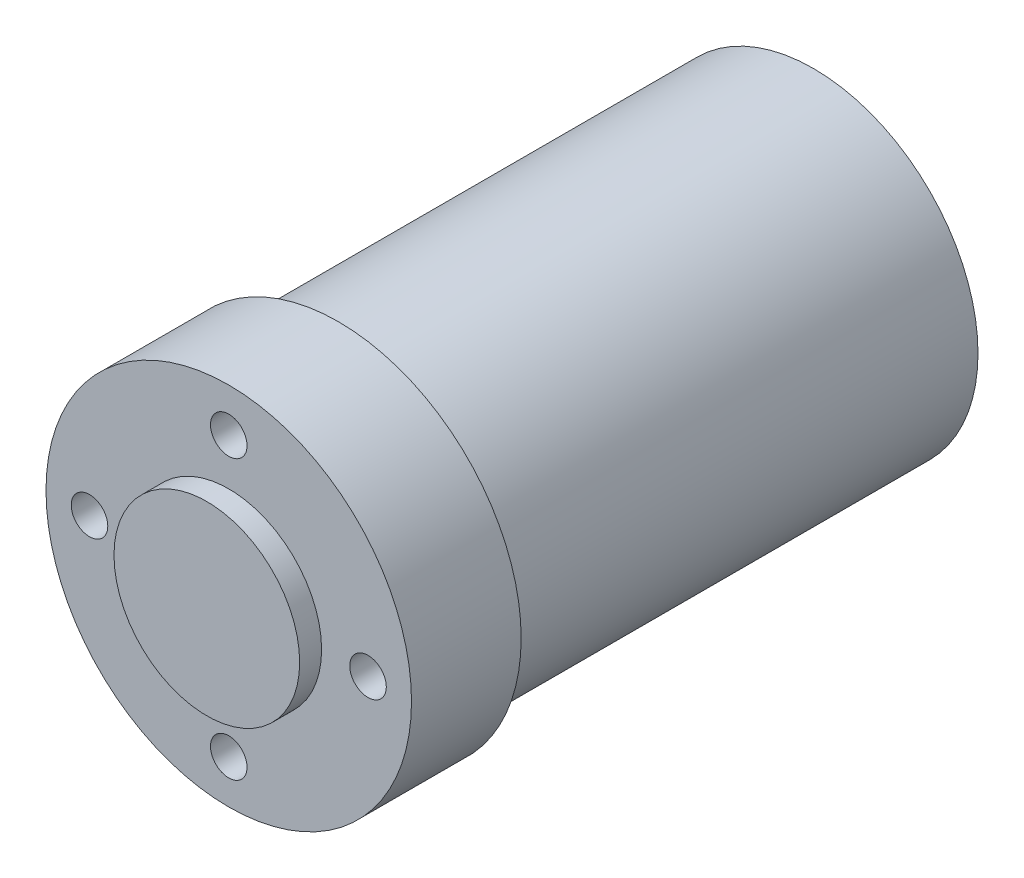
ISO-10303-21;
HEADER;
FILE_DESCRIPTION(('STEP AP214'),'2;1');
FILE_NAME('part.step','',(''),(''),'','','');
FILE_SCHEMA(('AUTOMOTIVE_DESIGN { 1 0 10303 214 1 1 1 1 }'));
ENDSEC;
DATA;
#1=APPLICATION_CONTEXT('core data for automotive mechanical design processes');
#2=APPLICATION_PROTOCOL_DEFINITION('international standard','automotive_design',2000,#1);
#3=PRODUCT_CONTEXT('',#1,'mechanical');
#4=PRODUCT('Part','Part','',(#3));
#5=PRODUCT_RELATED_PRODUCT_CATEGORY('part','',(#4));
#6=PRODUCT_DEFINITION_FORMATION('','',#4);
#7=PRODUCT_DEFINITION_CONTEXT('part definition',#1,'design');
#8=PRODUCT_DEFINITION('design','',#6,#7);
#9=PRODUCT_DEFINITION_SHAPE('','',#8);
#10=(LENGTH_UNIT() NAMED_UNIT(*) SI_UNIT(.MILLI.,.METRE.));
#11=(NAMED_UNIT(*) PLANE_ANGLE_UNIT() SI_UNIT($,.RADIAN.));
#12=(NAMED_UNIT(*) SI_UNIT($,.STERADIAN.) SOLID_ANGLE_UNIT());
#13=UNCERTAINTY_MEASURE_WITH_UNIT(LENGTH_MEASURE(1.E-05),#10,'distance_accuracy_value','');
#14=(GEOMETRIC_REPRESENTATION_CONTEXT(3) GLOBAL_UNCERTAINTY_ASSIGNED_CONTEXT((#13)) GLOBAL_UNIT_ASSIGNED_CONTEXT((#10,
#11,#12)) REPRESENTATION_CONTEXT('',''));
#15=CARTESIAN_POINT('',(0.,0.,0.));
#16=DIRECTION('',(0.,0.,1.));
#17=DIRECTION('',(1.,0.,0.));
#18=AXIS2_PLACEMENT_3D('',#15,#16,#17);
#19=CARTESIAN_POINT('',(0.,0.,80.));
#20=DIRECTION('',(0.,0.,-1.));
#21=DIRECTION('',(-1.,0.,0.));
#22=AXIS2_PLACEMENT_3D('',#19,#20,#21);
#23=CYLINDRICAL_SURFACE('',#22,25.);
#24=CARTESIAN_POINT('',(0.,0.,80.));
#25=DIRECTION('',(0.,0.,-1.));
#26=DIRECTION('',(-1.,0.,0.));
#27=AXIS2_PLACEMENT_3D('',#24,#25,#26);
#28=CIRCLE('',#27,25.);
#29=CARTESIAN_POINT('',(-25.,0.,80.));
#30=VERTEX_POINT('',#29);
#31=EDGE_CURVE('E10',#30,#30,#28,.T.);
#32=ORIENTED_EDGE('',*,*,#31,.T.);
#33=EDGE_LOOP('',(#32));
#34=FACE_BOUND('',#33,.T.);
#35=CARTESIAN_POINT('',(0.,0.,65.));
#36=DIRECTION('',(0.,0.,-1.));
#37=DIRECTION('',(-1.,0.,0.));
#38=AXIS2_PLACEMENT_3D('',#35,#36,#37);
#39=CIRCLE('',#38,25.);
#40=CARTESIAN_POINT('',(-25.,0.,65.));
#41=VERTEX_POINT('',#40);
#42=EDGE_CURVE('E39',#41,#41,#39,.T.);
#43=ORIENTED_EDGE('',*,*,#42,.F.);
#44=EDGE_LOOP('',(#43));
#45=FACE_BOUND('',#44,.T.);
#46=ADVANCED_FACE('F33',(#34,#45),#23,.T.);
#47=CARTESIAN_POINT('',(25.,0.,80.));
#48=DIRECTION('',(0.,0.,1.));
#49=DIRECTION('',(1.,0.,0.));
#50=AXIS2_PLACEMENT_3D('',#47,#48,#49);
#51=PLANE('',#50);
#52=CARTESIAN_POINT('',(-19.0499999999995,-5.41433564649196E-13,80.));
#53=DIRECTION('',(0.,0.,1.));
#54=DIRECTION('',(1.,0.,0.));
#55=AXIS2_PLACEMENT_3D('',#52,#53,#54);
#56=CIRCLE('',#55,2.50000000000086);
#57=CARTESIAN_POINT('',(-16.5499999999986,-5.41433564649196E-13,80.));
#58=VERTEX_POINT('',#57);
#59=EDGE_CURVE('E127',#58,#58,#56,.T.);
#60=ORIENTED_EDGE('',*,*,#59,.F.);
#61=EDGE_LOOP('',(#60));
#62=FACE_BOUND('',#61,.T.);
#63=CARTESIAN_POINT('',(1.07820122499364E-12,-19.05,80.));
#64=DIRECTION('',(0.,0.,1.));
#65=DIRECTION('',(1.,0.,0.));
#66=AXIS2_PLACEMENT_3D('',#63,#64,#65);
#67=CIRCLE('',#66,2.50000000000086);
#68=CARTESIAN_POINT('',(2.50000000000193,-19.05,80.));
#69=VERTEX_POINT('',#68);
#70=EDGE_CURVE('E121',#69,#69,#67,.T.);
#71=ORIENTED_EDGE('',*,*,#70,.F.);
#72=EDGE_LOOP('',(#71));
#73=FACE_BOUND('',#72,.T.);
#74=CARTESIAN_POINT('',(19.0500000000005,5.39100612496821E-13,80.));
#75=DIRECTION('',(0.,0.,1.));
#76=DIRECTION('',(1.,0.,0.));
#77=AXIS2_PLACEMENT_3D('',#74,#75,#76);
#78=CIRCLE('',#77,2.50000000000086);
#79=CARTESIAN_POINT('',(21.5500000000014,5.39100612496821E-13,80.));
#80=VERTEX_POINT('',#79);
#81=EDGE_CURVE('E115',#80,#80,#78,.T.);
#82=ORIENTED_EDGE('',*,*,#81,.F.);
#83=EDGE_LOOP('',(#82));
#84=FACE_BOUND('',#83,.T.);
#85=CARTESIAN_POINT('',(0.,19.05,80.));
#86=DIRECTION('',(0.,0.,1.));
#87=DIRECTION('',(1.,0.,0.));
#88=AXIS2_PLACEMENT_3D('',#85,#86,#87);
#89=CIRCLE('',#88,2.50000000000086);
#90=CARTESIAN_POINT('',(2.50000000000086,19.05,80.));
#91=VERTEX_POINT('',#90);
#92=EDGE_CURVE('E109',#91,#91,#89,.T.);
#93=ORIENTED_EDGE('',*,*,#92,.F.);
#94=EDGE_LOOP('',(#93));
#95=FACE_BOUND('',#94,.T.);
#96=CARTESIAN_POINT('',(0.,0.,80.));
#97=DIRECTION('',(0.,0.,1.));
#98=DIRECTION('',(1.,0.,0.));
#99=AXIS2_PLACEMENT_3D('',#96,#97,#98);
#100=CIRCLE('',#99,12.7);
#101=CARTESIAN_POINT('',(12.7,0.,80.));
#102=VERTEX_POINT('',#101);
#103=EDGE_CURVE('E47',#102,#102,#100,.T.);
#104=ORIENTED_EDGE('',*,*,#103,.F.);
#105=EDGE_LOOP('',(#104));
#106=FACE_BOUND('',#105,.T.);
#107=ORIENTED_EDGE('',*,*,#31,.F.);
#108=EDGE_LOOP('',(#107));
#109=FACE_BOUND('',#108,.T.);
#110=ADVANCED_FACE('F133',(#62,#73,#84,#95,#106,#109),#51,.T.);
#111=CARTESIAN_POINT('',(0.,0.,65.));
#112=DIRECTION('',(0.,0.,-1.));
#113=DIRECTION('',(-1.,0.,0.));
#114=AXIS2_PLACEMENT_3D('',#111,#112,#113);
#115=PLANE('',#114);
#116=CARTESIAN_POINT('',(0.,0.,65.));
#117=DIRECTION('',(0.,0.,-1.));
#118=DIRECTION('',(-1.,0.,0.));
#119=AXIS2_PLACEMENT_3D('',#116,#117,#118);
#120=CIRCLE('',#119,22.4917);
#121=CARTESIAN_POINT('',(-22.4917,0.,65.));
#122=VERTEX_POINT('',#121);
#123=EDGE_CURVE('E53',#122,#122,#120,.T.);
#124=ORIENTED_EDGE('',*,*,#123,.F.);
#125=EDGE_LOOP('',(#124));
#126=FACE_BOUND('',#125,.T.);
#127=ORIENTED_EDGE('',*,*,#42,.T.);
#128=EDGE_LOOP('',(#127));
#129=FACE_BOUND('',#128,.T.);
#130=ADVANCED_FACE('F136',(#126,#129),#115,.T.);
#131=CARTESIAN_POINT('',(0.,0.,83.));
#132=DIRECTION('',(0.,0.,-1.));
#133=DIRECTION('',(-1.,0.,0.));
#134=AXIS2_PLACEMENT_3D('',#131,#132,#133);
#135=CYLINDRICAL_SURFACE('',#134,12.7);
#136=CARTESIAN_POINT('',(0.,0.,83.));
#137=DIRECTION('',(0.,0.,1.));
#138=DIRECTION('',(1.,0.,0.));
#139=AXIS2_PLACEMENT_3D('',#136,#137,#138);
#140=CIRCLE('',#139,12.7);
#141=CARTESIAN_POINT('',(12.7,0.,83.));
#142=VERTEX_POINT('',#141);
#143=EDGE_CURVE('E43',#142,#142,#140,.T.);
#144=ORIENTED_EDGE('',*,*,#143,.F.);
#145=EDGE_LOOP('',(#144));
#146=FACE_BOUND('',#145,.T.);
#147=ORIENTED_EDGE('',*,*,#103,.T.);
#148=EDGE_LOOP('',(#147));
#149=FACE_BOUND('',#148,.T.);
#150=ADVANCED_FACE('F146',(#146,#149),#135,.T.);
#151=CARTESIAN_POINT('',(0.,0.,83.));
#152=DIRECTION('',(0.,0.,1.));
#153=DIRECTION('',(1.,0.,0.));
#154=AXIS2_PLACEMENT_3D('',#151,#152,#153);
#155=PLANE('',#154);
#156=ORIENTED_EDGE('',*,*,#143,.T.);
#157=EDGE_LOOP('',(#156));
#158=FACE_BOUND('',#157,.T.);
#159=ADVANCED_FACE('F148',(#158),#155,.T.);
#160=CARTESIAN_POINT('',(0.,0.,0.));
#161=DIRECTION('',(0.,0.,1.));
#162=DIRECTION('',(1.,0.,0.));
#163=AXIS2_PLACEMENT_3D('',#160,#161,#162);
#164=CYLINDRICAL_SURFACE('',#163,22.4917);
#165=CARTESIAN_POINT('',(0.,0.,0.));
#166=DIRECTION('',(0.,0.,-1.));
#167=DIRECTION('',(-1.,0.,0.));
#168=AXIS2_PLACEMENT_3D('',#165,#166,#167);
#169=CIRCLE('',#168,22.4917);
#170=CARTESIAN_POINT('',(-22.4917,0.,0.));
#171=VERTEX_POINT('',#170);
#172=EDGE_CURVE('E51',#171,#171,#169,.T.);
#173=ORIENTED_EDGE('',*,*,#172,.F.);
#174=EDGE_LOOP('',(#173));
#175=FACE_BOUND('',#174,.T.);
#176=ORIENTED_EDGE('',*,*,#123,.T.);
#177=EDGE_LOOP('',(#176));
#178=FACE_BOUND('',#177,.T.);
#179=ADVANCED_FACE('F155',(#175,#178),#164,.T.);
#180=CARTESIAN_POINT('',(0.,0.,0.));
#181=DIRECTION('',(0.,0.,-1.));
#182=DIRECTION('',(-1.,0.,0.));
#183=AXIS2_PLACEMENT_3D('',#180,#181,#182);
#184=PLANE('',#183);
#185=CARTESIAN_POINT('',(12.3743686707641,12.3743686707635,0.));
#186=DIRECTION('',(0.,0.,-1.));
#187=DIRECTION('',(-1.,0.,0.));
#188=AXIS2_PLACEMENT_3D('',#185,#186,#187);
#189=CIRCLE('',#188,2.49999999999999);
#190=CARTESIAN_POINT('',(9.87436867076416,12.3743686707635,0.));
#191=VERTEX_POINT('',#190);
#192=EDGE_CURVE('E103',#191,#191,#189,.T.);
#193=ORIENTED_EDGE('',*,*,#192,.F.);
#194=EDGE_LOOP('',(#193));
#195=FACE_BOUND('',#194,.T.);
#196=CARTESIAN_POINT('',(17.4999999999985,-1.49213974509621E-12,0.));
#197=DIRECTION('',(0.,0.,-1.));
#198=DIRECTION('',(-1.,0.,0.));
#199=AXIS2_PLACEMENT_3D('',#196,#197,#198);
#200=CIRCLE('',#199,2.49999999999999);
#201=CARTESIAN_POINT('',(14.9999999999985,-1.49213974509621E-12,0.));
#202=VERTEX_POINT('',#201);
#203=EDGE_CURVE('E97',#202,#202,#200,.T.);
#204=ORIENTED_EDGE('',*,*,#203,.F.);
#205=EDGE_LOOP('',(#204));
#206=FACE_BOUND('',#205,.T.);
#207=CARTESIAN_POINT('',(12.374368670762,-12.3743686707656,0.));
#208=DIRECTION('',(0.,0.,-1.));
#209=DIRECTION('',(-1.,0.,0.));
#210=AXIS2_PLACEMENT_3D('',#207,#208,#209);
#211=CIRCLE('',#210,2.49999999999999);
#212=CARTESIAN_POINT('',(9.87436867076205,-12.3743686707656,0.));
#213=VERTEX_POINT('',#212);
#214=EDGE_CURVE('E91',#213,#213,#211,.T.);
#215=ORIENTED_EDGE('',*,*,#214,.F.);
#216=EDGE_LOOP('',(#215));
#217=FACE_BOUND('',#216,.T.);
#218=CARTESIAN_POINT('',(-2.97999322639541E-12,-17.5,0.));
#219=DIRECTION('',(0.,0.,-1.));
#220=DIRECTION('',(-1.,0.,0.));
#221=AXIS2_PLACEMENT_3D('',#218,#219,#220);
#222=CIRCLE('',#221,2.49999999999999);
#223=CARTESIAN_POINT('',(-2.50000000000297,-17.5,0.));
#224=VERTEX_POINT('',#223);
#225=EDGE_CURVE('E85',#224,#224,#222,.T.);
#226=ORIENTED_EDGE('',*,*,#225,.F.);
#227=EDGE_LOOP('',(#226));
#228=FACE_BOUND('',#227,.T.);
#229=CARTESIAN_POINT('',(-12.3743686707671,-12.3743686707635,0.));
#230=DIRECTION('',(0.,0.,-1.));
#231=DIRECTION('',(-1.,0.,0.));
#232=AXIS2_PLACEMENT_3D('',#229,#230,#231);
#233=CIRCLE('',#232,2.49999999999999);
#234=CARTESIAN_POINT('',(-14.8743686707671,-12.3743686707635,0.));
#235=VERTEX_POINT('',#234);
#236=EDGE_CURVE('E79',#235,#235,#233,.T.);
#237=ORIENTED_EDGE('',*,*,#236,.F.);
#238=EDGE_LOOP('',(#237));
#239=FACE_BOUND('',#238,.T.);
#240=CARTESIAN_POINT('',(-17.5000000000015,1.4899966131977E-12,0.));
#241=DIRECTION('',(0.,0.,-1.));
#242=DIRECTION('',(-1.,0.,0.));
#243=AXIS2_PLACEMENT_3D('',#240,#241,#242);
#244=CIRCLE('',#243,2.49999999999999);
#245=CARTESIAN_POINT('',(-20.0000000000015,1.4899966131977E-12,0.));
#246=VERTEX_POINT('',#245);
#247=EDGE_CURVE('E73',#246,#246,#244,.T.);
#248=ORIENTED_EDGE('',*,*,#247,.F.);
#249=EDGE_LOOP('',(#248));
#250=FACE_BOUND('',#249,.T.);
#251=CARTESIAN_POINT('',(-12.374368670765,12.3743686707656,0.));
#252=DIRECTION('',(0.,0.,-1.));
#253=DIRECTION('',(-1.,0.,0.));
#254=AXIS2_PLACEMENT_3D('',#251,#252,#253);
#255=CIRCLE('',#254,2.49999999999999);
#256=CARTESIAN_POINT('',(-14.874368670765,12.3743686707656,0.));
#257=VERTEX_POINT('',#256);
#258=EDGE_CURVE('E67',#257,#257,#255,.T.);
#259=ORIENTED_EDGE('',*,*,#258,.F.);
#260=EDGE_LOOP('',(#259));
#261=FACE_BOUND('',#260,.T.);
#262=CARTESIAN_POINT('',(0.,17.5,0.));
#263=DIRECTION('',(0.,0.,-1.));
#264=DIRECTION('',(-1.,0.,0.));
#265=AXIS2_PLACEMENT_3D('',#262,#263,#264);
#266=CIRCLE('',#265,2.49999999999999);
#267=CARTESIAN_POINT('',(-2.49999999999999,17.5,0.));
#268=VERTEX_POINT('',#267);
#269=EDGE_CURVE('E61',#268,#268,#266,.T.);
#270=ORIENTED_EDGE('',*,*,#269,.F.);
#271=EDGE_LOOP('',(#270));
#272=FACE_BOUND('',#271,.T.);
#273=ORIENTED_EDGE('',*,*,#172,.T.);
#274=EDGE_LOOP('',(#273));
#275=FACE_BOUND('',#274,.T.);
#276=ADVANCED_FACE('F188',(#195,#206,#217,#228,#239,#250,#261,#272,#275),#184,.T.);
#277=CARTESIAN_POINT('',(0.,17.5,7.99999999999999));
#278=DIRECTION('',(0.,0.,1.));
#279=DIRECTION('',(1.,0.,0.));
#280=AXIS2_PLACEMENT_3D('',#277,#278,#279);
#281=PLANE('',#280);
#282=CARTESIAN_POINT('',(0.,17.5,7.99999999999999));
#283=DIRECTION('',(0.,0.,-1.));
#284=DIRECTION('',(-1.,0.,0.));
#285=AXIS2_PLACEMENT_3D('',#282,#283,#284);
#286=CIRCLE('',#285,2.49999999999999);
#287=CARTESIAN_POINT('',(-2.49999999999999,17.5,7.99999999999999));
#288=VERTEX_POINT('',#287);
#289=EDGE_CURVE('E56',#288,#288,#286,.T.);
#290=ORIENTED_EDGE('',*,*,#289,.T.);
#291=EDGE_LOOP('',(#290));
#292=FACE_BOUND('',#291,.T.);
#293=ADVANCED_FACE('F198',(#292),#281,.F.);
#294=CARTESIAN_POINT('',(0.,17.5,0.));
#295=DIRECTION('',(0.,0.,-1.));
#296=DIRECTION('',(-1.,0.,0.));
#297=AXIS2_PLACEMENT_3D('',#294,#295,#296);
#298=CYLINDRICAL_SURFACE('',#297,2.49999999999999);
#299=ORIENTED_EDGE('',*,*,#289,.F.);
#300=EDGE_LOOP('',(#299));
#301=FACE_BOUND('',#300,.T.);
#302=ORIENTED_EDGE('',*,*,#269,.T.);
#303=EDGE_LOOP('',(#302));
#304=FACE_BOUND('',#303,.T.);
#305=ADVANCED_FACE('F208',(#301,#304),#298,.F.);
#306=CARTESIAN_POINT('',(-12.374368670765,12.3743686707656,7.99999999999999));
#307=DIRECTION('',(0.,0.,1.));
#308=DIRECTION('',(1.,0.,0.));
#309=AXIS2_PLACEMENT_3D('',#306,#307,#308);
#310=PLANE('',#309);
#311=CARTESIAN_POINT('',(-12.374368670765,12.3743686707656,7.99999999999999));
#312=DIRECTION('',(0.,0.,-1.));
#313=DIRECTION('',(-1.,0.,0.));
#314=AXIS2_PLACEMENT_3D('',#311,#312,#313);
#315=CIRCLE('',#314,2.49999999999999);
#316=CARTESIAN_POINT('',(-14.874368670765,12.3743686707656,7.99999999999999));
#317=VERTEX_POINT('',#316);
#318=EDGE_CURVE('E64',#317,#317,#315,.T.);
#319=ORIENTED_EDGE('',*,*,#318,.T.);
#320=EDGE_LOOP('',(#319));
#321=FACE_BOUND('',#320,.T.);
#322=ADVANCED_FACE('F218',(#321),#310,.F.);
#323=CARTESIAN_POINT('',(-12.374368670765,12.3743686707656,0.));
#324=DIRECTION('',(0.,0.,-1.));
#325=DIRECTION('',(-1.,0.,0.));
#326=AXIS2_PLACEMENT_3D('',#323,#324,#325);
#327=CYLINDRICAL_SURFACE('',#326,2.49999999999999);
#328=ORIENTED_EDGE('',*,*,#318,.F.);
#329=EDGE_LOOP('',(#328));
#330=FACE_BOUND('',#329,.T.);
#331=ORIENTED_EDGE('',*,*,#258,.T.);
#332=EDGE_LOOP('',(#331));
#333=FACE_BOUND('',#332,.T.);
#334=ADVANCED_FACE('F228',(#330,#333),#327,.F.);
#335=CARTESIAN_POINT('',(-17.5000000000015,1.4899966131977E-12,7.99999999999999));
#336=DIRECTION('',(0.,0.,1.));
#337=DIRECTION('',(1.,0.,0.));
#338=AXIS2_PLACEMENT_3D('',#335,#336,#337);
#339=PLANE('',#338);
#340=CARTESIAN_POINT('',(-17.5000000000015,1.4899966131977E-12,7.99999999999999));
#341=DIRECTION('',(0.,0.,-1.));
#342=DIRECTION('',(-1.,0.,0.));
#343=AXIS2_PLACEMENT_3D('',#340,#341,#342);
#344=CIRCLE('',#343,2.49999999999999);
#345=CARTESIAN_POINT('',(-20.0000000000015,1.4899966131977E-12,7.99999999999999));
#346=VERTEX_POINT('',#345);
#347=EDGE_CURVE('E70',#346,#346,#344,.T.);
#348=ORIENTED_EDGE('',*,*,#347,.T.);
#349=EDGE_LOOP('',(#348));
#350=FACE_BOUND('',#349,.T.);
#351=ADVANCED_FACE('F238',(#350),#339,.F.);
#352=CARTESIAN_POINT('',(-17.5000000000015,1.4899966131977E-12,0.));
#353=DIRECTION('',(0.,0.,-1.));
#354=DIRECTION('',(-1.,0.,0.));
#355=AXIS2_PLACEMENT_3D('',#352,#353,#354);
#356=CYLINDRICAL_SURFACE('',#355,2.49999999999999);
#357=ORIENTED_EDGE('',*,*,#347,.F.);
#358=EDGE_LOOP('',(#357));
#359=FACE_BOUND('',#358,.T.);
#360=ORIENTED_EDGE('',*,*,#247,.T.);
#361=EDGE_LOOP('',(#360));
#362=FACE_BOUND('',#361,.T.);
#363=ADVANCED_FACE('F248',(#359,#362),#356,.F.);
#364=CARTESIAN_POINT('',(-12.3743686707671,-12.3743686707635,7.99999999999999));
#365=DIRECTION('',(0.,0.,1.));
#366=DIRECTION('',(1.,0.,0.));
#367=AXIS2_PLACEMENT_3D('',#364,#365,#366);
#368=PLANE('',#367);
#369=CARTESIAN_POINT('',(-12.3743686707671,-12.3743686707635,7.99999999999999));
#370=DIRECTION('',(0.,0.,-1.));
#371=DIRECTION('',(-1.,0.,0.));
#372=AXIS2_PLACEMENT_3D('',#369,#370,#371);
#373=CIRCLE('',#372,2.49999999999999);
#374=CARTESIAN_POINT('',(-14.8743686707671,-12.3743686707635,7.99999999999999));
#375=VERTEX_POINT('',#374);
#376=EDGE_CURVE('E76',#375,#375,#373,.T.);
#377=ORIENTED_EDGE('',*,*,#376,.T.);
#378=EDGE_LOOP('',(#377));
#379=FACE_BOUND('',#378,.T.);
#380=ADVANCED_FACE('F258',(#379),#368,.F.);
#381=CARTESIAN_POINT('',(-12.3743686707671,-12.3743686707635,0.));
#382=DIRECTION('',(0.,0.,-1.));
#383=DIRECTION('',(-1.,0.,0.));
#384=AXIS2_PLACEMENT_3D('',#381,#382,#383);
#385=CYLINDRICAL_SURFACE('',#384,2.49999999999999);
#386=ORIENTED_EDGE('',*,*,#376,.F.);
#387=EDGE_LOOP('',(#386));
#388=FACE_BOUND('',#387,.T.);
#389=ORIENTED_EDGE('',*,*,#236,.T.);
#390=EDGE_LOOP('',(#389));
#391=FACE_BOUND('',#390,.T.);
#392=ADVANCED_FACE('F268',(#388,#391),#385,.F.);
#393=CARTESIAN_POINT('',(-2.98195266127404E-12,-17.5,7.99999999999999));
#394=DIRECTION('',(0.,0.,1.));
#395=DIRECTION('',(1.,0.,0.));
#396=AXIS2_PLACEMENT_3D('',#393,#394,#395);
#397=PLANE('',#396);
#398=CARTESIAN_POINT('',(-2.97999322639541E-12,-17.5,7.99999999999999));
#399=DIRECTION('',(0.,0.,-1.));
#400=DIRECTION('',(-1.,0.,0.));
#401=AXIS2_PLACEMENT_3D('',#398,#399,#400);
#402=CIRCLE('',#401,2.49999999999999);
#403=CARTESIAN_POINT('',(-2.50000000000297,-17.5,7.99999999999999));
#404=VERTEX_POINT('',#403);
#405=EDGE_CURVE('E82',#404,#404,#402,.T.);
#406=ORIENTED_EDGE('',*,*,#405,.T.);
#407=EDGE_LOOP('',(#406));
#408=FACE_BOUND('',#407,.T.);
#409=ADVANCED_FACE('F278',(#408),#397,.F.);
#410=CARTESIAN_POINT('',(-2.97999322639541E-12,-17.5,0.));
#411=DIRECTION('',(0.,0.,-1.));
#412=DIRECTION('',(-1.,0.,0.));
#413=AXIS2_PLACEMENT_3D('',#410,#411,#412);
#414=CYLINDRICAL_SURFACE('',#413,2.49999999999999);
#415=ORIENTED_EDGE('',*,*,#405,.F.);
#416=EDGE_LOOP('',(#415));
#417=FACE_BOUND('',#416,.T.);
#418=ORIENTED_EDGE('',*,*,#225,.T.);
#419=EDGE_LOOP('',(#418));
#420=FACE_BOUND('',#419,.T.);
#421=ADVANCED_FACE('F288',(#417,#420),#414,.F.);
#422=CARTESIAN_POINT('',(12.374368670762,-12.3743686707656,7.99999999999999));
#423=DIRECTION('',(0.,0.,1.));
#424=DIRECTION('',(1.,0.,0.));
#425=AXIS2_PLACEMENT_3D('',#422,#423,#424);
#426=PLANE('',#425);
#427=CARTESIAN_POINT('',(12.374368670762,-12.3743686707656,7.99999999999999));
#428=DIRECTION('',(0.,0.,-1.));
#429=DIRECTION('',(-1.,0.,0.));
#430=AXIS2_PLACEMENT_3D('',#427,#428,#429);
#431=CIRCLE('',#430,2.49999999999999);
#432=CARTESIAN_POINT('',(9.87436867076205,-12.3743686707656,7.99999999999999));
#433=VERTEX_POINT('',#432);
#434=EDGE_CURVE('E88',#433,#433,#431,.T.);
#435=ORIENTED_EDGE('',*,*,#434,.T.);
#436=EDGE_LOOP('',(#435));
#437=FACE_BOUND('',#436,.T.);
#438=ADVANCED_FACE('F298',(#437),#426,.F.);
#439=CARTESIAN_POINT('',(12.374368670762,-12.3743686707656,0.));
#440=DIRECTION('',(0.,0.,-1.));
#441=DIRECTION('',(-1.,0.,0.));
#442=AXIS2_PLACEMENT_3D('',#439,#440,#441);
#443=CYLINDRICAL_SURFACE('',#442,2.49999999999999);
#444=ORIENTED_EDGE('',*,*,#434,.F.);
#445=EDGE_LOOP('',(#444));
#446=FACE_BOUND('',#445,.T.);
#447=ORIENTED_EDGE('',*,*,#214,.T.);
#448=EDGE_LOOP('',(#447));
#449=FACE_BOUND('',#448,.T.);
#450=ADVANCED_FACE('F308',(#446,#449),#443,.F.);
#451=CARTESIAN_POINT('',(17.4999999999985,-1.49213974509621E-12,7.99999999999999));
#452=DIRECTION('',(0.,0.,1.));
#453=DIRECTION('',(1.,0.,0.));
#454=AXIS2_PLACEMENT_3D('',#451,#452,#453);
#455=PLANE('',#454);
#456=CARTESIAN_POINT('',(17.4999999999985,-1.49213974509621E-12,7.99999999999999));
#457=DIRECTION('',(0.,0.,-1.));
#458=DIRECTION('',(-1.,0.,0.));
#459=AXIS2_PLACEMENT_3D('',#456,#457,#458);
#460=CIRCLE('',#459,2.49999999999999);
#461=CARTESIAN_POINT('',(14.9999999999985,-1.49213974509621E-12,7.99999999999999));
#462=VERTEX_POINT('',#461);
#463=EDGE_CURVE('E94',#462,#462,#460,.T.);
#464=ORIENTED_EDGE('',*,*,#463,.T.);
#465=EDGE_LOOP('',(#464));
#466=FACE_BOUND('',#465,.T.);
#467=ADVANCED_FACE('F318',(#466),#455,.F.);
#468=CARTESIAN_POINT('',(17.4999999999985,-1.49213974509621E-12,0.));
#469=DIRECTION('',(0.,0.,-1.));
#470=DIRECTION('',(-1.,0.,0.));
#471=AXIS2_PLACEMENT_3D('',#468,#469,#470);
#472=CYLINDRICAL_SURFACE('',#471,2.49999999999999);
#473=ORIENTED_EDGE('',*,*,#463,.F.);
#474=EDGE_LOOP('',(#473));
#475=FACE_BOUND('',#474,.T.);
#476=ORIENTED_EDGE('',*,*,#203,.T.);
#477=EDGE_LOOP('',(#476));
#478=FACE_BOUND('',#477,.T.);
#479=ADVANCED_FACE('F328',(#475,#478),#472,.F.);
#480=CARTESIAN_POINT('',(12.3743686707641,12.3743686707635,7.99999999999999));
#481=DIRECTION('',(0.,0.,1.));
#482=DIRECTION('',(1.,0.,0.));
#483=AXIS2_PLACEMENT_3D('',#480,#481,#482);
#484=PLANE('',#483);
#485=CARTESIAN_POINT('',(12.3743686707641,12.3743686707635,7.99999999999999));
#486=DIRECTION('',(0.,0.,-1.));
#487=DIRECTION('',(-1.,0.,0.));
#488=AXIS2_PLACEMENT_3D('',#485,#486,#487);
#489=CIRCLE('',#488,2.49999999999999);
#490=CARTESIAN_POINT('',(9.87436867076416,12.3743686707635,7.99999999999999));
#491=VERTEX_POINT('',#490);
#492=EDGE_CURVE('E100',#491,#491,#489,.T.);
#493=ORIENTED_EDGE('',*,*,#492,.T.);
#494=EDGE_LOOP('',(#493));
#495=FACE_BOUND('',#494,.T.);
#496=ADVANCED_FACE('F338',(#495),#484,.F.);
#497=CARTESIAN_POINT('',(12.3743686707641,12.3743686707635,0.));
#498=DIRECTION('',(0.,0.,-1.));
#499=DIRECTION('',(-1.,0.,0.));
#500=AXIS2_PLACEMENT_3D('',#497,#498,#499);
#501=CYLINDRICAL_SURFACE('',#500,2.49999999999999);
#502=ORIENTED_EDGE('',*,*,#492,.F.);
#503=EDGE_LOOP('',(#502));
#504=FACE_BOUND('',#503,.T.);
#505=ORIENTED_EDGE('',*,*,#192,.T.);
#506=EDGE_LOOP('',(#505));
#507=FACE_BOUND('',#506,.T.);
#508=ADVANCED_FACE('F347',(#504,#507),#501,.F.);
#509=CARTESIAN_POINT('',(0.,19.05,67.554));
#510=DIRECTION('',(0.,0.,-1.));
#511=DIRECTION('',(-1.,0.,0.));
#512=AXIS2_PLACEMENT_3D('',#509,#510,#511);
#513=PLANE('',#512);
#514=CARTESIAN_POINT('',(0.,19.05,67.554));
#515=DIRECTION('',(0.,0.,1.));
#516=DIRECTION('',(1.,0.,0.));
#517=AXIS2_PLACEMENT_3D('',#514,#515,#516);
#518=CIRCLE('',#517,2.50000000000085);
#519=CARTESIAN_POINT('',(2.50000000000085,19.05,67.554));
#520=VERTEX_POINT('',#519);
#521=EDGE_CURVE('E106',#520,#520,#518,.T.);
#522=ORIENTED_EDGE('',*,*,#521,.T.);
#523=EDGE_LOOP('',(#522));
#524=FACE_BOUND('',#523,.T.);
#525=ADVANCED_FACE('F356',(#524),#513,.F.);
#526=CARTESIAN_POINT('',(0.,19.05,80.));
#527=DIRECTION('',(0.,0.,1.));
#528=DIRECTION('',(1.,0.,0.));
#529=AXIS2_PLACEMENT_3D('',#526,#527,#528);
#530=CYLINDRICAL_SURFACE('',#529,2.50000000000085);
#531=ORIENTED_EDGE('',*,*,#521,.F.);
#532=EDGE_LOOP('',(#531));
#533=FACE_BOUND('',#532,.T.);
#534=ORIENTED_EDGE('',*,*,#92,.T.);
#535=EDGE_LOOP('',(#534));
#536=FACE_BOUND('',#535,.T.);
#537=ADVANCED_FACE('F366',(#533,#536),#530,.F.);
#538=CARTESIAN_POINT('',(19.0500000000005,5.39100612496821E-13,67.554));
#539=DIRECTION('',(0.,0.,-1.));
#540=DIRECTION('',(-1.,0.,0.));
#541=AXIS2_PLACEMENT_3D('',#538,#539,#540);
#542=PLANE('',#541);
#543=CARTESIAN_POINT('',(19.0500000000005,5.39100612496821E-13,67.554));
#544=DIRECTION('',(0.,0.,1.));
#545=DIRECTION('',(1.,0.,0.));
#546=AXIS2_PLACEMENT_3D('',#543,#544,#545);
#547=CIRCLE('',#546,2.50000000000086);
#548=CARTESIAN_POINT('',(21.5500000000014,5.39100612496821E-13,67.554));
#549=VERTEX_POINT('',#548);
#550=EDGE_CURVE('E112',#549,#549,#547,.T.);
#551=ORIENTED_EDGE('',*,*,#550,.T.);
#552=EDGE_LOOP('',(#551));
#553=FACE_BOUND('',#552,.T.);
#554=ADVANCED_FACE('F373',(#553),#542,.F.);
#555=CARTESIAN_POINT('',(19.0500000000005,5.39100612496821E-13,80.));
#556=DIRECTION('',(0.,0.,1.));
#557=DIRECTION('',(1.,0.,0.));
#558=AXIS2_PLACEMENT_3D('',#555,#556,#557);
#559=CYLINDRICAL_SURFACE('',#558,2.50000000000086);
#560=ORIENTED_EDGE('',*,*,#550,.F.);
#561=EDGE_LOOP('',(#560));
#562=FACE_BOUND('',#561,.T.);
#563=ORIENTED_EDGE('',*,*,#81,.T.);
#564=EDGE_LOOP('',(#563));
#565=FACE_BOUND('',#564,.T.);
#566=ADVANCED_FACE('F381',(#562,#565),#559,.F.);
#567=CARTESIAN_POINT('',(1.0751528341812E-12,-19.05,67.554));
#568=DIRECTION('',(0.,0.,-1.));
#569=DIRECTION('',(-1.,0.,0.));
#570=AXIS2_PLACEMENT_3D('',#567,#568,#569);
#571=PLANE('',#570);
#572=CARTESIAN_POINT('',(1.07820122499364E-12,-19.05,67.554));
#573=DIRECTION('',(0.,0.,1.));
#574=DIRECTION('',(1.,0.,0.));
#575=AXIS2_PLACEMENT_3D('',#572,#573,#574);
#576=CIRCLE('',#575,2.50000000000085);
#577=CARTESIAN_POINT('',(2.50000000000193,-19.05,67.554));
#578=VERTEX_POINT('',#577);
#579=EDGE_CURVE('E118',#578,#578,#576,.T.);
#580=ORIENTED_EDGE('',*,*,#579,.T.);
#581=EDGE_LOOP('',(#580));
#582=FACE_BOUND('',#581,.T.);
#583=ADVANCED_FACE('F389',(#582),#571,.F.);
#584=CARTESIAN_POINT('',(1.07820122499364E-12,-19.05,80.));
#585=DIRECTION('',(0.,0.,1.));
#586=DIRECTION('',(1.,0.,0.));
#587=AXIS2_PLACEMENT_3D('',#584,#585,#586);
#588=CYLINDRICAL_SURFACE('',#587,2.50000000000085);
#589=ORIENTED_EDGE('',*,*,#579,.F.);
#590=EDGE_LOOP('',(#589));
#591=FACE_BOUND('',#590,.T.);
#592=ORIENTED_EDGE('',*,*,#70,.T.);
#593=EDGE_LOOP('',(#592));
#594=FACE_BOUND('',#593,.T.);
#595=ADVANCED_FACE('F397',(#591,#594),#588,.F.);
#596=CARTESIAN_POINT('',(-19.0499999999995,-5.41433564649196E-13,67.554));
#597=DIRECTION('',(0.,0.,-1.));
#598=DIRECTION('',(-1.,0.,0.));
#599=AXIS2_PLACEMENT_3D('',#596,#597,#598);
#600=PLANE('',#599);
#601=CARTESIAN_POINT('',(-19.0499999999995,-5.41433564649196E-13,67.554));
#602=DIRECTION('',(0.,0.,1.));
#603=DIRECTION('',(1.,0.,0.));
#604=AXIS2_PLACEMENT_3D('',#601,#602,#603);
#605=CIRCLE('',#604,2.50000000000086);
#606=CARTESIAN_POINT('',(-16.5499999999986,-5.41433564649196E-13,67.554));
#607=VERTEX_POINT('',#606);
#608=EDGE_CURVE('E124',#607,#607,#605,.T.);
#609=ORIENTED_EDGE('',*,*,#608,.T.);
#610=EDGE_LOOP('',(#609));
#611=FACE_BOUND('',#610,.T.);
#612=ADVANCED_FACE('F405',(#611),#600,.F.);
#613=CARTESIAN_POINT('',(-19.0499999999995,-5.41433564649196E-13,80.));
#614=DIRECTION('',(0.,0.,1.));
#615=DIRECTION('',(1.,0.,0.));
#616=AXIS2_PLACEMENT_3D('',#613,#614,#615);
#617=CYLINDRICAL_SURFACE('',#616,2.50000000000086);
#618=ORIENTED_EDGE('',*,*,#608,.F.);
#619=EDGE_LOOP('',(#618));
#620=FACE_BOUND('',#619,.T.);
#621=ORIENTED_EDGE('',*,*,#59,.T.);
#622=EDGE_LOOP('',(#621));
#623=FACE_BOUND('',#622,.T.);
#624=ADVANCED_FACE('F131',(#620,#623),#617,.F.);
#625=CLOSED_SHELL('',(#46,#110,#130,#150,#159,#179,#276,#293,#305,#322,#334,#351,#363,#380,#392,
#409,#421,#438,#450,#467,#479,#496,#508,#525,#537,#554,#566,#583,#595,#612,#624));
#626=MANIFOLD_SOLID_BREP('B2',#625);
#627=ADVANCED_BREP_SHAPE_REPRESENTATION('',(#18,#626),#14);
#628=SHAPE_DEFINITION_REPRESENTATION(#9,#627);
ENDSEC;
END-ISO-10303-21;
